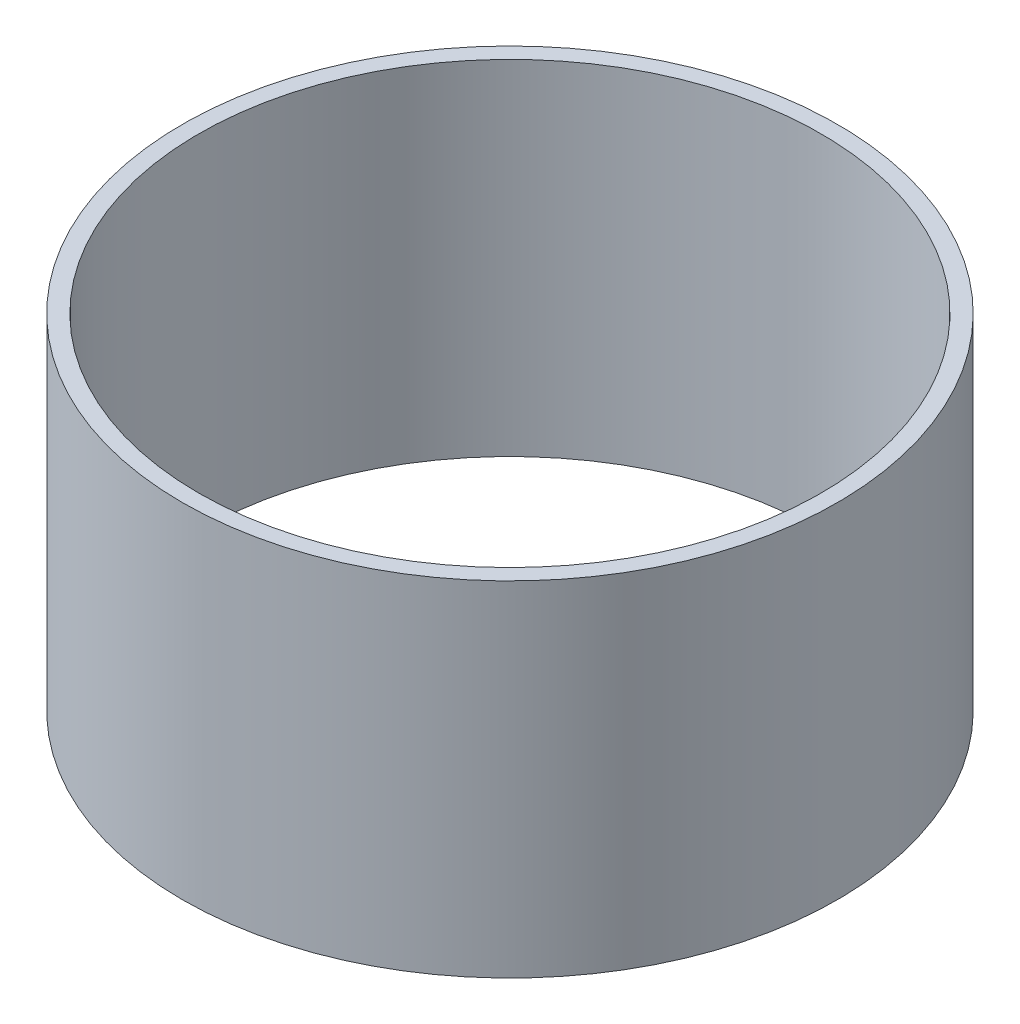
ISO-10303-21;
HEADER;
FILE_DESCRIPTION(('STEP AP214'),'2;1');
FILE_NAME('part.step','',(''),(''),'','','');
FILE_SCHEMA(('AUTOMOTIVE_DESIGN { 1 0 10303 214 1 1 1 1 }'));
ENDSEC;
DATA;
#1=APPLICATION_CONTEXT('core data for automotive mechanical design processes');
#2=APPLICATION_PROTOCOL_DEFINITION('international standard','automotive_design',2000,#1);
#3=PRODUCT_CONTEXT('',#1,'mechanical');
#4=PRODUCT('Part','Part','',(#3));
#5=PRODUCT_RELATED_PRODUCT_CATEGORY('part','',(#4));
#6=PRODUCT_DEFINITION_FORMATION('','',#4);
#7=PRODUCT_DEFINITION_CONTEXT('part definition',#1,'design');
#8=PRODUCT_DEFINITION('design','',#6,#7);
#9=PRODUCT_DEFINITION_SHAPE('','',#8);
#10=(LENGTH_UNIT() NAMED_UNIT(*) SI_UNIT(.MILLI.,.METRE.));
#11=(NAMED_UNIT(*) PLANE_ANGLE_UNIT() SI_UNIT($,.RADIAN.));
#12=(NAMED_UNIT(*) SI_UNIT($,.STERADIAN.) SOLID_ANGLE_UNIT());
#13=UNCERTAINTY_MEASURE_WITH_UNIT(LENGTH_MEASURE(1.E-05),#10,'distance_accuracy_value','');
#14=(GEOMETRIC_REPRESENTATION_CONTEXT(3) GLOBAL_UNCERTAINTY_ASSIGNED_CONTEXT((#13)) GLOBAL_UNIT_ASSIGNED_CONTEXT((#10,
#11,#12)) REPRESENTATION_CONTEXT('',''));
#15=CARTESIAN_POINT('',(0.,0.,0.));
#16=DIRECTION('',(0.,0.,1.));
#17=DIRECTION('',(1.,0.,0.));
#18=AXIS2_PLACEMENT_3D('',#15,#16,#17);
#19=CARTESIAN_POINT('',(0.,42.,0.));
#20=DIRECTION('',(0.,1.,0.));
#21=DIRECTION('',(0.,0.,1.));
#22=AXIS2_PLACEMENT_3D('',#19,#20,#21);
#23=PLANE('',#22);
#24=CARTESIAN_POINT('',(0.,42.,0.));
#25=DIRECTION('',(0.,1.,0.));
#26=DIRECTION('',(0.,0.,1.));
#27=AXIS2_PLACEMENT_3D('',#24,#25,#26);
#28=CIRCLE('',#27,40.);
#29=CARTESIAN_POINT('',(0.,42.,40.));
#30=VERTEX_POINT('',#29);
#31=EDGE_CURVE('E10',#30,#30,#28,.T.);
#32=ORIENTED_EDGE('',*,*,#31,.T.);
#33=EDGE_LOOP('',(#32));
#34=FACE_BOUND('',#33,.T.);
#35=CARTESIAN_POINT('',(0.,42.,0.));
#36=DIRECTION('',(0.,1.,0.));
#37=DIRECTION('',(0.,0.,1.));
#38=AXIS2_PLACEMENT_3D('',#35,#36,#37);
#39=CIRCLE('',#38,38.);
#40=CARTESIAN_POINT('',(0.,42.,38.));
#41=VERTEX_POINT('',#40);
#42=EDGE_CURVE('E52',#41,#41,#39,.T.);
#43=ORIENTED_EDGE('',*,*,#42,.F.);
#44=EDGE_LOOP('',(#43));
#45=FACE_BOUND('',#44,.T.);
#46=ADVANCED_FACE('F39',(#34,#45),#23,.T.);
#47=CARTESIAN_POINT('',(0.,0.,0.));
#48=DIRECTION('',(0.,1.,0.));
#49=DIRECTION('',(0.,0.,1.));
#50=AXIS2_PLACEMENT_3D('',#47,#48,#49);
#51=PLANE('',#50);
#52=CARTESIAN_POINT('',(0.,0.,0.));
#53=DIRECTION('',(0.,1.,0.));
#54=DIRECTION('',(0.,0.,1.));
#55=AXIS2_PLACEMENT_3D('',#52,#53,#54);
#56=CIRCLE('',#55,40.);
#57=CARTESIAN_POINT('',(0.,0.,40.));
#58=VERTEX_POINT('',#57);
#59=EDGE_CURVE('E43',#58,#58,#56,.T.);
#60=ORIENTED_EDGE('',*,*,#59,.F.);
#61=EDGE_LOOP('',(#60));
#62=FACE_BOUND('',#61,.T.);
#63=CARTESIAN_POINT('',(0.,0.,0.));
#64=DIRECTION('',(0.,1.,0.));
#65=DIRECTION('',(0.,0.,1.));
#66=AXIS2_PLACEMENT_3D('',#63,#64,#65);
#67=CIRCLE('',#66,38.);
#68=CARTESIAN_POINT('',(0.,0.,38.));
#69=VERTEX_POINT('',#68);
#70=EDGE_CURVE('E54',#69,#69,#67,.T.);
#71=ORIENTED_EDGE('',*,*,#70,.T.);
#72=EDGE_LOOP('',(#71));
#73=FACE_BOUND('',#72,.T.);
#74=ADVANCED_FACE('F66',(#62,#73),#51,.F.);
#75=CARTESIAN_POINT('',(0.,42.,0.));
#76=DIRECTION('',(0.,-1.,0.));
#77=DIRECTION('',(0.,0.,-1.));
#78=AXIS2_PLACEMENT_3D('',#75,#76,#77);
#79=CYLINDRICAL_SURFACE('',#78,40.);
#80=ORIENTED_EDGE('',*,*,#31,.F.);
#81=EDGE_LOOP('',(#80));
#82=FACE_BOUND('',#81,.T.);
#83=ORIENTED_EDGE('',*,*,#59,.T.);
#84=EDGE_LOOP('',(#83));
#85=FACE_BOUND('',#84,.T.);
#86=ADVANCED_FACE('F41',(#82,#85),#79,.T.);
#87=CARTESIAN_POINT('',(0.,42.,0.));
#88=DIRECTION('',(0.,-1.,0.));
#89=DIRECTION('',(0.,0.,-1.));
#90=AXIS2_PLACEMENT_3D('',#87,#88,#89);
#91=CYLINDRICAL_SURFACE('',#90,38.);
#92=ORIENTED_EDGE('',*,*,#42,.T.);
#93=EDGE_LOOP('',(#92));
#94=FACE_BOUND('',#93,.T.);
#95=ORIENTED_EDGE('',*,*,#70,.F.);
#96=EDGE_LOOP('',(#95));
#97=FACE_BOUND('',#96,.T.);
#98=ADVANCED_FACE('F62',(#94,#97),#91,.F.);
#99=CLOSED_SHELL('',(#46,#74,#86,#98));
#100=MANIFOLD_SOLID_BREP('B2',#99);
#101=ADVANCED_BREP_SHAPE_REPRESENTATION('',(#18,#100),#14);
#102=SHAPE_DEFINITION_REPRESENTATION(#9,#101);
ENDSEC;
END-ISO-10303-21;
